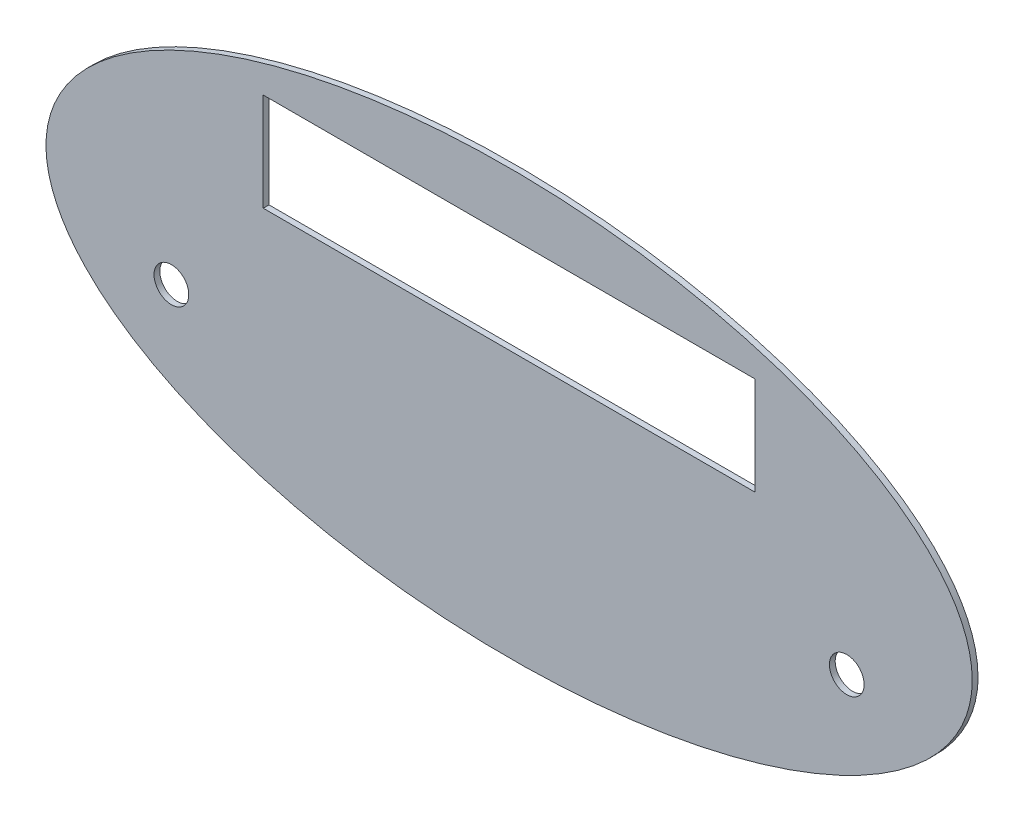
ISO-10303-21;
HEADER;
FILE_DESCRIPTION(('STEP AP214'),'2;1');
FILE_NAME('part.step','',(''),(''),'','','');
FILE_SCHEMA(('AUTOMOTIVE_DESIGN { 1 0 10303 214 1 1 1 1 }'));
ENDSEC;
DATA;
#1=APPLICATION_CONTEXT('core data for automotive mechanical design processes');
#2=APPLICATION_PROTOCOL_DEFINITION('international standard','automotive_design',2000,#1);
#3=PRODUCT_CONTEXT('',#1,'mechanical');
#4=PRODUCT('Part','Part','',(#3));
#5=PRODUCT_RELATED_PRODUCT_CATEGORY('part','',(#4));
#6=PRODUCT_DEFINITION_FORMATION('','',#4);
#7=PRODUCT_DEFINITION_CONTEXT('part definition',#1,'design');
#8=PRODUCT_DEFINITION('design','',#6,#7);
#9=PRODUCT_DEFINITION_SHAPE('','',#8);
#10=(LENGTH_UNIT() NAMED_UNIT(*) SI_UNIT(.MILLI.,.METRE.));
#11=(NAMED_UNIT(*) PLANE_ANGLE_UNIT() SI_UNIT($,.RADIAN.));
#12=(NAMED_UNIT(*) SI_UNIT($,.STERADIAN.) SOLID_ANGLE_UNIT());
#13=UNCERTAINTY_MEASURE_WITH_UNIT(LENGTH_MEASURE(1.E-05),#10,'distance_accuracy_value','');
#14=(GEOMETRIC_REPRESENTATION_CONTEXT(3) GLOBAL_UNCERTAINTY_ASSIGNED_CONTEXT((#13)) GLOBAL_UNIT_ASSIGNED_CONTEXT((#10,
#11,#12)) REPRESENTATION_CONTEXT('',''));
#15=CARTESIAN_POINT('',(0.,0.,0.));
#16=DIRECTION('',(0.,0.,1.));
#17=DIRECTION('',(1.,0.,0.));
#18=AXIS2_PLACEMENT_3D('',#15,#16,#17);
#19=CARTESIAN_POINT('',(0.,0.,-3.));
#20=DIRECTION('',(0.,0.,1.));
#21=DIRECTION('',(1.,0.,0.));
#22=AXIS2_PLACEMENT_3D('',#19,#20,#21);
#23=ELLIPSE('',#22,240.,110.);
#24=DIRECTION('',(0.,0.,1.));
#25=VECTOR('',#24,1.);
#26=SURFACE_OF_LINEAR_EXTRUSION('',#23,#25);
#27=CARTESIAN_POINT('',(240.,0.,-3.));
#28=VERTEX_POINT('',#27);
#29=EDGE_CURVE('E11',#28,#28,#23,.T.);
#30=ORIENTED_EDGE('',*,*,#29,.T.);
#31=EDGE_LOOP('',(#30));
#32=FACE_BOUND('',#31,.T.);
#33=CARTESIAN_POINT('',(0.,0.,0.));
#34=DIRECTION('',(0.,0.,1.));
#35=DIRECTION('',(1.,0.,0.));
#36=AXIS2_PLACEMENT_3D('',#33,#34,#35);
#37=ELLIPSE('',#36,240.,110.);
#38=CARTESIAN_POINT('',(240.,0.,0.));
#39=VERTEX_POINT('',#38);
#40=EDGE_CURVE('E39',#39,#39,#37,.T.);
#41=ORIENTED_EDGE('',*,*,#40,.F.);
#42=EDGE_LOOP('',(#41));
#43=FACE_BOUND('',#42,.T.);
#44=ADVANCED_FACE('F35',(#32,#43),#26,.T.);
#45=CARTESIAN_POINT('',(0.,0.,-3.));
#46=DIRECTION('',(0.,0.,1.));
#47=DIRECTION('',(1.,0.,0.));
#48=AXIS2_PLACEMENT_3D('',#45,#46,#47);
#49=PLANE('',#48);
#50=CARTESIAN_POINT('',(175.,-30.,-3.));
#51=DIRECTION('',(0.,0.,1.));
#52=DIRECTION('',(1.,0.,0.));
#53=AXIS2_PLACEMENT_3D('',#50,#51,#52);
#54=CIRCLE('',#53,9.00000000000001);
#55=CARTESIAN_POINT('',(184.,-30.,-3.));
#56=VERTEX_POINT('',#55);
#57=EDGE_CURVE('E106',#56,#56,#54,.T.);
#58=ORIENTED_EDGE('',*,*,#57,.T.);
#59=EDGE_LOOP('',(#58));
#60=FACE_BOUND('',#59,.T.);
#61=CARTESIAN_POINT('',(-175.,-30.,-3.));
#62=DIRECTION('',(0.,0.,1.));
#63=DIRECTION('',(-1.,0.,0.));
#64=AXIS2_PLACEMENT_3D('',#61,#62,#63);
#65=CIRCLE('',#64,9.00000000000001);
#66=CARTESIAN_POINT('',(-184.,-30.,-3.));
#67=VERTEX_POINT('',#66);
#68=EDGE_CURVE('E165',#67,#67,#65,.T.);
#69=ORIENTED_EDGE('',*,*,#68,.T.);
#70=EDGE_LOOP('',(#69));
#71=FACE_BOUND('',#70,.T.);
#72=DIRECTION('',(-1.,0.,0.));
#73=VECTOR('',#72,1.);
#74=CARTESIAN_POINT('',(-127.4,78.9000000000001,-3.));
#75=LINE('',#74,#73);
#76=CARTESIAN_POINT('',(127.4,78.9,-3.));
#77=VERTEX_POINT('',#76);
#78=CARTESIAN_POINT('',(-127.4,78.9000000000001,-3.));
#79=VERTEX_POINT('',#78);
#80=EDGE_CURVE('E83',#77,#79,#75,.T.);
#81=ORIENTED_EDGE('',*,*,#80,.T.);
#82=DIRECTION('',(0.,-1.,0.));
#83=VECTOR('',#82,1.);
#84=CARTESIAN_POINT('',(-127.4,78.9000000000001,-3.));
#85=LINE('',#84,#83);
#86=CARTESIAN_POINT('',(-127.4,28.1,-3.));
#87=VERTEX_POINT('',#86);
#88=EDGE_CURVE('E77',#79,#87,#85,.T.);
#89=ORIENTED_EDGE('',*,*,#88,.T.);
#90=DIRECTION('',(1.,0.,0.));
#91=VECTOR('',#90,1.);
#92=CARTESIAN_POINT('',(-127.4,28.1,-3.));
#93=LINE('',#92,#91);
#94=CARTESIAN_POINT('',(127.4,28.1,-3.));
#95=VERTEX_POINT('',#94);
#96=EDGE_CURVE('E86',#87,#95,#93,.T.);
#97=ORIENTED_EDGE('',*,*,#96,.T.);
#98=DIRECTION('',(0.,1.,0.));
#99=VECTOR('',#98,1.);
#100=CARTESIAN_POINT('',(127.4,78.9,-3.));
#101=LINE('',#100,#99);
#102=EDGE_CURVE('E49',#95,#77,#101,.T.);
#103=ORIENTED_EDGE('',*,*,#102,.T.);
#104=EDGE_LOOP('',(#81,#89,#97,#103));
#105=FACE_BOUND('',#104,.T.);
#106=ORIENTED_EDGE('',*,*,#29,.F.);
#107=EDGE_LOOP('',(#106));
#108=FACE_BOUND('',#107,.T.);
#109=ADVANCED_FACE('F90',(#60,#71,#105,#108),#49,.F.);
#110=CARTESIAN_POINT('',(0.,0.,0.));
#111=DIRECTION('',(0.,0.,1.));
#112=DIRECTION('',(1.,0.,0.));
#113=AXIS2_PLACEMENT_3D('',#110,#111,#112);
#114=PLANE('',#113);
#115=CARTESIAN_POINT('',(175.,-30.,0.));
#116=DIRECTION('',(0.,0.,1.));
#117=DIRECTION('',(1.,0.,0.));
#118=AXIS2_PLACEMENT_3D('',#115,#116,#117);
#119=CIRCLE('',#118,9.00000000000001);
#120=CARTESIAN_POINT('',(184.,-30.,0.));
#121=VERTEX_POINT('',#120);
#122=EDGE_CURVE('E168',#121,#121,#119,.T.);
#123=ORIENTED_EDGE('',*,*,#122,.F.);
#124=EDGE_LOOP('',(#123));
#125=FACE_BOUND('',#124,.T.);
#126=CARTESIAN_POINT('',(-175.,-30.,0.));
#127=DIRECTION('',(0.,0.,1.));
#128=DIRECTION('',(-1.,0.,0.));
#129=AXIS2_PLACEMENT_3D('',#126,#127,#128);
#130=CIRCLE('',#129,9.00000000000001);
#131=CARTESIAN_POINT('',(-184.,-30.,0.));
#132=VERTEX_POINT('',#131);
#133=EDGE_CURVE('E99',#132,#132,#130,.T.);
#134=ORIENTED_EDGE('',*,*,#133,.F.);
#135=EDGE_LOOP('',(#134));
#136=FACE_BOUND('',#135,.T.);
#137=DIRECTION('',(0.,-1.,0.));
#138=VECTOR('',#137,1.);
#139=CARTESIAN_POINT('',(-127.4,78.9000000000001,0.));
#140=LINE('',#139,#138);
#141=CARTESIAN_POINT('',(-127.4,78.9000000000001,0.));
#142=VERTEX_POINT('',#141);
#143=CARTESIAN_POINT('',(-127.4,28.1,0.));
#144=VERTEX_POINT('',#143);
#145=EDGE_CURVE('E57',#142,#144,#140,.T.);
#146=ORIENTED_EDGE('',*,*,#145,.F.);
#147=DIRECTION('',(-1.,0.,0.));
#148=VECTOR('',#147,1.);
#149=CARTESIAN_POINT('',(-127.4,78.9000000000001,0.));
#150=LINE('',#149,#148);
#151=CARTESIAN_POINT('',(127.4,78.9,0.));
#152=VERTEX_POINT('',#151);
#153=EDGE_CURVE('E93',#152,#142,#150,.T.);
#154=ORIENTED_EDGE('',*,*,#153,.F.);
#155=DIRECTION('',(0.,1.,0.));
#156=VECTOR('',#155,1.);
#157=CARTESIAN_POINT('',(127.4,78.9,0.));
#158=LINE('',#157,#156);
#159=CARTESIAN_POINT('',(127.4,28.1,0.));
#160=VERTEX_POINT('',#159);
#161=EDGE_CURVE('E96',#160,#152,#158,.T.);
#162=ORIENTED_EDGE('',*,*,#161,.F.);
#163=DIRECTION('',(1.,0.,0.));
#164=VECTOR('',#163,1.);
#165=CARTESIAN_POINT('',(-127.4,28.1,0.));
#166=LINE('',#165,#164);
#167=EDGE_CURVE('E105',#144,#160,#166,.T.);
#168=ORIENTED_EDGE('',*,*,#167,.F.);
#169=EDGE_LOOP('',(#146,#154,#162,#168));
#170=FACE_BOUND('',#169,.T.);
#171=ORIENTED_EDGE('',*,*,#40,.T.);
#172=EDGE_LOOP('',(#171));
#173=FACE_BOUND('',#172,.T.);
#174=ADVANCED_FACE('F119',(#125,#136,#170,#173),#114,.T.);
#175=CARTESIAN_POINT('',(-127.4,78.9000000000001,-3.));
#176=DIRECTION('',(-1.,0.,0.));
#177=DIRECTION('',(0.,0.,1.));
#178=AXIS2_PLACEMENT_3D('',#175,#176,#177);
#179=PLANE('',#178);
#180=ORIENTED_EDGE('',*,*,#145,.T.);
#181=DIRECTION('',(0.,0.,1.));
#182=VECTOR('',#181,1.);
#183=CARTESIAN_POINT('',(-127.4,28.1,-3.));
#184=LINE('',#183,#182);
#185=EDGE_CURVE('E73',#87,#144,#184,.T.);
#186=ORIENTED_EDGE('',*,*,#185,.F.);
#187=ORIENTED_EDGE('',*,*,#88,.F.);
#188=DIRECTION('',(0.,0.,1.));
#189=VECTOR('',#188,1.);
#190=CARTESIAN_POINT('',(-127.4,78.9000000000001,-3.));
#191=LINE('',#190,#189);
#192=EDGE_CURVE('E110',#79,#142,#191,.T.);
#193=ORIENTED_EDGE('',*,*,#192,.T.);
#194=EDGE_LOOP('',(#180,#186,#187,#193));
#195=FACE_BOUND('',#194,.T.);
#196=ADVANCED_FACE('F75',(#195),#179,.F.);
#197=CARTESIAN_POINT('',(-127.4,78.9000000000001,-3.));
#198=DIRECTION('',(0.,1.,0.));
#199=DIRECTION('',(-1.,0.,0.));
#200=AXIS2_PLACEMENT_3D('',#197,#198,#199);
#201=PLANE('',#200);
#202=ORIENTED_EDGE('',*,*,#153,.T.);
#203=ORIENTED_EDGE('',*,*,#192,.F.);
#204=ORIENTED_EDGE('',*,*,#80,.F.);
#205=DIRECTION('',(0.,0.,1.));
#206=VECTOR('',#205,1.);
#207=CARTESIAN_POINT('',(127.4,78.9,-3.));
#208=LINE('',#207,#206);
#209=EDGE_CURVE('E112',#77,#152,#208,.T.);
#210=ORIENTED_EDGE('',*,*,#209,.T.);
#211=EDGE_LOOP('',(#202,#203,#204,#210));
#212=FACE_BOUND('',#211,.T.);
#213=ADVANCED_FACE('F122',(#212),#201,.F.);
#214=CARTESIAN_POINT('',(127.4,78.9,-3.));
#215=DIRECTION('',(1.,0.,0.));
#216=DIRECTION('',(0.,0.,-1.));
#217=AXIS2_PLACEMENT_3D('',#214,#215,#216);
#218=PLANE('',#217);
#219=ORIENTED_EDGE('',*,*,#161,.T.);
#220=ORIENTED_EDGE('',*,*,#209,.F.);
#221=ORIENTED_EDGE('',*,*,#102,.F.);
#222=DIRECTION('',(0.,0.,1.));
#223=VECTOR('',#222,1.);
#224=CARTESIAN_POINT('',(127.4,28.1,-3.));
#225=LINE('',#224,#223);
#226=EDGE_CURVE('E82',#95,#160,#225,.T.);
#227=ORIENTED_EDGE('',*,*,#226,.T.);
#228=EDGE_LOOP('',(#219,#220,#221,#227));
#229=FACE_BOUND('',#228,.T.);
#230=ADVANCED_FACE('F115',(#229),#218,.F.);
#231=CARTESIAN_POINT('',(-127.4,28.1,-3.));
#232=DIRECTION('',(0.,-1.,0.));
#233=DIRECTION('',(1.,0.,0.));
#234=AXIS2_PLACEMENT_3D('',#231,#232,#233);
#235=PLANE('',#234);
#236=ORIENTED_EDGE('',*,*,#167,.T.);
#237=ORIENTED_EDGE('',*,*,#226,.F.);
#238=ORIENTED_EDGE('',*,*,#96,.F.);
#239=ORIENTED_EDGE('',*,*,#185,.T.);
#240=EDGE_LOOP('',(#236,#237,#238,#239));
#241=FACE_BOUND('',#240,.T.);
#242=ADVANCED_FACE('F87',(#241),#235,.F.);
#243=CARTESIAN_POINT('',(-175.,-30.,-3.));
#244=DIRECTION('',(0.,0.,1.));
#245=DIRECTION('',(1.,0.,0.));
#246=AXIS2_PLACEMENT_3D('',#243,#244,#245);
#247=CYLINDRICAL_SURFACE('',#246,9.00000000000001);
#248=ORIENTED_EDGE('',*,*,#68,.F.);
#249=EDGE_LOOP('',(#248));
#250=FACE_BOUND('',#249,.T.);
#251=ORIENTED_EDGE('',*,*,#133,.T.);
#252=EDGE_LOOP('',(#251));
#253=FACE_BOUND('',#252,.T.);
#254=ADVANCED_FACE('F151',(#250,#253),#247,.F.);
#255=CARTESIAN_POINT('',(175.,-30.,-3.));
#256=DIRECTION('',(0.,0.,1.));
#257=DIRECTION('',(1.,0.,0.));
#258=AXIS2_PLACEMENT_3D('',#255,#256,#257);
#259=CYLINDRICAL_SURFACE('',#258,9.00000000000001);
#260=ORIENTED_EDGE('',*,*,#57,.F.);
#261=EDGE_LOOP('',(#260));
#262=FACE_BOUND('',#261,.T.);
#263=ORIENTED_EDGE('',*,*,#122,.T.);
#264=EDGE_LOOP('',(#263));
#265=FACE_BOUND('',#264,.T.);
#266=ADVANCED_FACE('F155',(#262,#265),#259,.F.);
#267=CLOSED_SHELL('',(#44,#109,#174,#196,#213,#230,#242,#254,#266));
#268=MANIFOLD_SOLID_BREP('B2',#267);
#269=ADVANCED_BREP_SHAPE_REPRESENTATION('',(#18,#268),#14);
#270=SHAPE_DEFINITION_REPRESENTATION(#9,#269);
ENDSEC;
END-ISO-10303-21;
